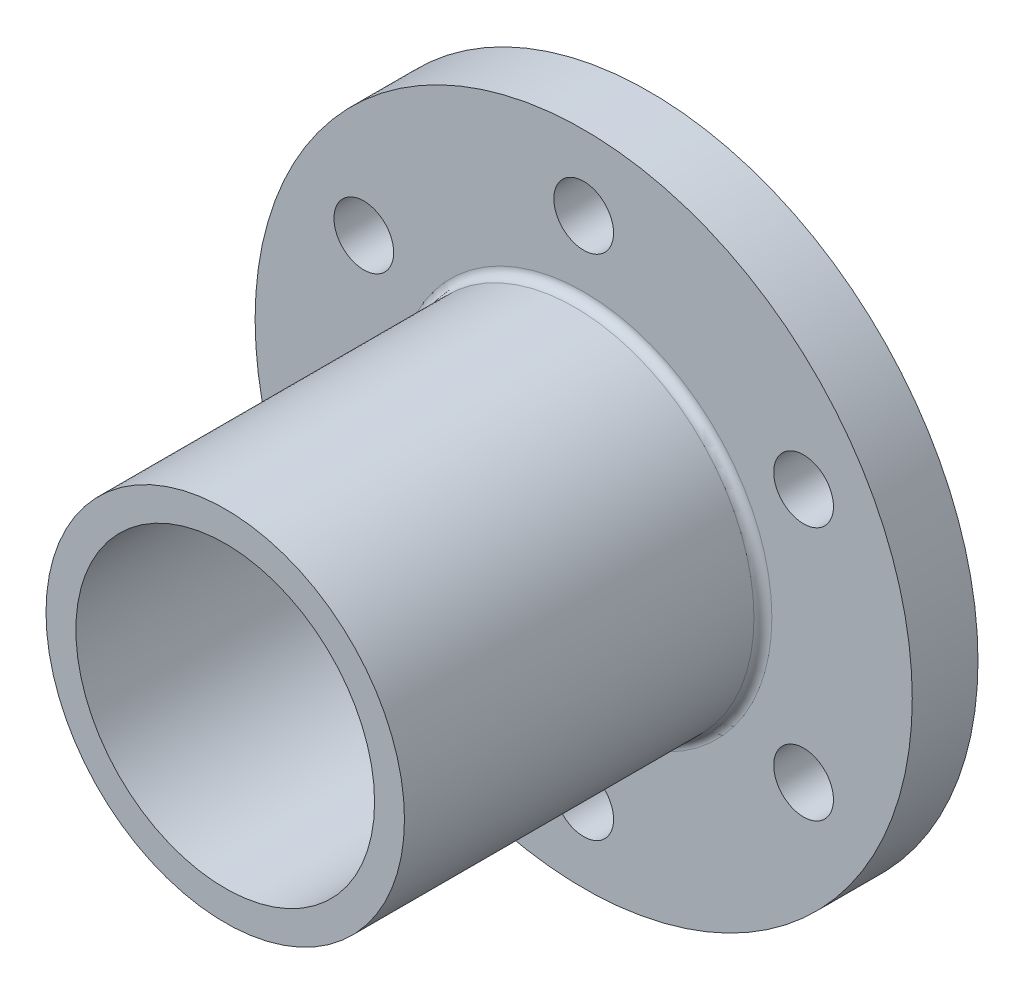
ISO-10303-21;
HEADER;
FILE_DESCRIPTION(('STEP AP214'),'2;1');
FILE_NAME('part.step','',(''),(''),'','','');
FILE_SCHEMA(('AUTOMOTIVE_DESIGN { 1 0 10303 214 1 1 1 1 }'));
ENDSEC;
DATA;
#1=APPLICATION_CONTEXT('core data for automotive mechanical design processes');
#2=APPLICATION_PROTOCOL_DEFINITION('international standard','automotive_design',2000,#1);
#3=PRODUCT_CONTEXT('',#1,'mechanical');
#4=PRODUCT('Part','Part','',(#3));
#5=PRODUCT_RELATED_PRODUCT_CATEGORY('part','',(#4));
#6=PRODUCT_DEFINITION_FORMATION('','',#4);
#7=PRODUCT_DEFINITION_CONTEXT('part definition',#1,'design');
#8=PRODUCT_DEFINITION('design','',#6,#7);
#9=PRODUCT_DEFINITION_SHAPE('','',#8);
#10=(LENGTH_UNIT() NAMED_UNIT(*) SI_UNIT(.MILLI.,.METRE.));
#11=(NAMED_UNIT(*) PLANE_ANGLE_UNIT() SI_UNIT($,.RADIAN.));
#12=(NAMED_UNIT(*) SI_UNIT($,.STERADIAN.) SOLID_ANGLE_UNIT());
#13=UNCERTAINTY_MEASURE_WITH_UNIT(LENGTH_MEASURE(1.E-05),#10,'distance_accuracy_value','');
#14=(GEOMETRIC_REPRESENTATION_CONTEXT(3) GLOBAL_UNCERTAINTY_ASSIGNED_CONTEXT((#13)) GLOBAL_UNIT_ASSIGNED_CONTEXT((#10,
#11,#12)) REPRESENTATION_CONTEXT('',''));
#15=CARTESIAN_POINT('',(0.,0.,0.));
#16=DIRECTION('',(0.,0.,1.));
#17=DIRECTION('',(1.,0.,0.));
#18=AXIS2_PLACEMENT_3D('',#15,#16,#17);
#19=CARTESIAN_POINT('',(0.,0.,22.));
#20=DIRECTION('',(0.,0.,1.));
#21=DIRECTION('',(1.,0.,0.));
#22=AXIS2_PLACEMENT_3D('',#19,#20,#21);
#23=PLANE('',#22);
#24=CARTESIAN_POINT('',(0.,0.,22.));
#25=DIRECTION('',(0.,0.,1.));
#26=DIRECTION('',(1.,0.,0.));
#27=AXIS2_PLACEMENT_3D('',#24,#25,#26);
#28=CIRCLE('',#27,63.);
#29=CARTESIAN_POINT('',(63.,0.,22.));
#30=VERTEX_POINT('',#29);
#31=EDGE_CURVE('E10',#30,#30,#28,.F.);
#32=ORIENTED_EDGE('',*,*,#31,.T.);
#33=EDGE_LOOP('',(#32));
#34=FACE_BOUND('',#33,.T.);
#35=CARTESIAN_POINT('',(-73.6121593216749,42.4999999999958,22.));
#36=DIRECTION('',(0.,0.,1.));
#37=DIRECTION('',(1.,0.,0.));
#38=AXIS2_PLACEMENT_3D('',#35,#36,#37);
#39=CIRCLE('',#38,10.0000000000045);
#40=CARTESIAN_POINT('',(-63.6121593216704,42.4999999999958,22.));
#41=VERTEX_POINT('',#40);
#42=EDGE_CURVE('E91',#41,#41,#39,.T.);
#43=ORIENTED_EDGE('',*,*,#42,.F.);
#44=EDGE_LOOP('',(#43));
#45=FACE_BOUND('',#44,.T.);
#46=CARTESIAN_POINT('',(-73.61215932167,-42.5000000000042,22.));
#47=DIRECTION('',(0.,0.,1.));
#48=DIRECTION('',(1.,0.,0.));
#49=AXIS2_PLACEMENT_3D('',#46,#47,#48);
#50=CIRCLE('',#49,10.0000000000089);
#51=CARTESIAN_POINT('',(-63.6121593216611,-42.5000000000042,22.));
#52=VERTEX_POINT('',#51);
#53=EDGE_CURVE('E85',#52,#52,#50,.T.);
#54=ORIENTED_EDGE('',*,*,#53,.F.);
#55=EDGE_LOOP('',(#54));
#56=FACE_BOUND('',#55,.T.);
#57=CARTESIAN_POINT('',(9.64256221075186E-12,-85.,22.));
#58=DIRECTION('',(0.,0.,1.));
#59=DIRECTION('',(1.,0.,0.));
#60=AXIS2_PLACEMENT_3D('',#57,#58,#59);
#61=CIRCLE('',#60,10.0000000000098);
#62=CARTESIAN_POINT('',(10.0000000000194,-85.,22.));
#63=VERTEX_POINT('',#62);
#64=EDGE_CURVE('E79',#63,#63,#61,.T.);
#65=ORIENTED_EDGE('',*,*,#64,.F.);
#66=EDGE_LOOP('',(#65));
#67=FACE_BOUND('',#66,.T.);
#68=CARTESIAN_POINT('',(73.6121593216845,-42.4999999999958,22.));
#69=DIRECTION('',(0.,0.,1.));
#70=DIRECTION('',(1.,0.,0.));
#71=AXIS2_PLACEMENT_3D('',#68,#69,#70);
#72=CIRCLE('',#71,10.0000000000061);
#73=CARTESIAN_POINT('',(83.6121593216906,-42.4999999999958,22.));
#74=VERTEX_POINT('',#73);
#75=EDGE_CURVE('E73',#74,#74,#72,.T.);
#76=ORIENTED_EDGE('',*,*,#75,.F.);
#77=EDGE_LOOP('',(#76));
#78=FACE_BOUND('',#77,.T.);
#79=CARTESIAN_POINT('',(73.6121593216797,42.5000000000042,22.));
#80=DIRECTION('',(0.,0.,1.));
#81=DIRECTION('',(1.,0.,0.));
#82=AXIS2_PLACEMENT_3D('',#79,#80,#81);
#83=CIRCLE('',#82,10.0000000000013);
#84=CARTESIAN_POINT('',(83.612159321681,42.5000000000042,22.));
#85=VERTEX_POINT('',#84);
#86=EDGE_CURVE('E67',#85,#85,#83,.T.);
#87=ORIENTED_EDGE('',*,*,#86,.F.);
#88=EDGE_LOOP('',(#87));
#89=FACE_BOUND('',#88,.T.);
#90=CARTESIAN_POINT('',(0.,85.,22.));
#91=DIRECTION('',(0.,0.,1.));
#92=DIRECTION('',(1.,0.,0.));
#93=AXIS2_PLACEMENT_3D('',#90,#91,#92);
#94=CIRCLE('',#93,10.);
#95=CARTESIAN_POINT('',(10.,85.,22.));
#96=VERTEX_POINT('',#95);
#97=EDGE_CURVE('E61',#96,#96,#94,.T.);
#98=ORIENTED_EDGE('',*,*,#97,.F.);
#99=EDGE_LOOP('',(#98));
#100=FACE_BOUND('',#99,.T.);
#101=CARTESIAN_POINT('',(0.,0.,22.));
#102=DIRECTION('',(0.,0.,1.));
#103=DIRECTION('',(1.,0.,0.));
#104=AXIS2_PLACEMENT_3D('',#101,#102,#103);
#105=CIRCLE('',#104,110.);
#106=CARTESIAN_POINT('',(110.,0.,22.));
#107=VERTEX_POINT('',#106);
#108=EDGE_CURVE('E42',#107,#107,#105,.T.);
#109=ORIENTED_EDGE('',*,*,#108,.T.);
#110=EDGE_LOOP('',(#109));
#111=FACE_BOUND('',#110,.T.);
#112=ADVANCED_FACE('F31',(#34,#45,#56,#67,#78,#89,#100,#111),#23,.T.);
#113=CARTESIAN_POINT('',(0.,0.,22.));
#114=DIRECTION('',(0.,0.,-1.));
#115=DIRECTION('',(-1.,0.,0.));
#116=AXIS2_PLACEMENT_3D('',#113,#114,#115);
#117=CYLINDRICAL_SURFACE('',#116,110.);
#118=ORIENTED_EDGE('',*,*,#108,.F.);
#119=EDGE_LOOP('',(#118));
#120=FACE_BOUND('',#119,.T.);
#121=CARTESIAN_POINT('',(0.,0.,0.));
#122=DIRECTION('',(0.,0.,1.));
#123=DIRECTION('',(1.,0.,0.));
#124=AXIS2_PLACEMENT_3D('',#121,#122,#123);
#125=CIRCLE('',#124,110.);
#126=CARTESIAN_POINT('',(110.,0.,0.));
#127=VERTEX_POINT('',#126);
#128=EDGE_CURVE('E46',#127,#127,#125,.T.);
#129=ORIENTED_EDGE('',*,*,#128,.T.);
#130=EDGE_LOOP('',(#129));
#131=FACE_BOUND('',#130,.T.);
#132=ADVANCED_FACE('F109',(#120,#131),#117,.T.);
#133=CARTESIAN_POINT('',(0.,0.,0.));
#134=DIRECTION('',(0.,0.,1.));
#135=DIRECTION('',(1.,0.,0.));
#136=AXIS2_PLACEMENT_3D('',#133,#134,#135);
#137=PLANE('',#136);
#138=CARTESIAN_POINT('',(-73.6121593216749,42.4999999999958,0.));
#139=DIRECTION('',(0.,0.,1.));
#140=DIRECTION('',(1.,0.,0.));
#141=AXIS2_PLACEMENT_3D('',#138,#139,#140);
#142=CIRCLE('',#141,10.0000000000045);
#143=CARTESIAN_POINT('',(-63.6121593216704,42.4999999999958,0.));
#144=VERTEX_POINT('',#143);
#145=EDGE_CURVE('E88',#144,#144,#142,.T.);
#146=ORIENTED_EDGE('',*,*,#145,.T.);
#147=EDGE_LOOP('',(#146));
#148=FACE_BOUND('',#147,.T.);
#149=CARTESIAN_POINT('',(-73.61215932167,-42.5000000000042,0.));
#150=DIRECTION('',(0.,0.,1.));
#151=DIRECTION('',(1.,0.,0.));
#152=AXIS2_PLACEMENT_3D('',#149,#150,#151);
#153=CIRCLE('',#152,10.0000000000089);
#154=CARTESIAN_POINT('',(-63.6121593216611,-42.5000000000042,0.));
#155=VERTEX_POINT('',#154);
#156=EDGE_CURVE('E82',#155,#155,#153,.T.);
#157=ORIENTED_EDGE('',*,*,#156,.T.);
#158=EDGE_LOOP('',(#157));
#159=FACE_BOUND('',#158,.T.);
#160=CARTESIAN_POINT('',(9.64256221075186E-12,-85.,0.));
#161=DIRECTION('',(0.,0.,1.));
#162=DIRECTION('',(1.,0.,0.));
#163=AXIS2_PLACEMENT_3D('',#160,#161,#162);
#164=CIRCLE('',#163,10.0000000000098);
#165=CARTESIAN_POINT('',(10.0000000000194,-85.,0.));
#166=VERTEX_POINT('',#165);
#167=EDGE_CURVE('E76',#166,#166,#164,.T.);
#168=ORIENTED_EDGE('',*,*,#167,.T.);
#169=EDGE_LOOP('',(#168));
#170=FACE_BOUND('',#169,.T.);
#171=CARTESIAN_POINT('',(73.6121593216845,-42.4999999999958,0.));
#172=DIRECTION('',(0.,0.,1.));
#173=DIRECTION('',(1.,0.,0.));
#174=AXIS2_PLACEMENT_3D('',#171,#172,#173);
#175=CIRCLE('',#174,10.0000000000061);
#176=CARTESIAN_POINT('',(83.6121593216906,-42.4999999999958,0.));
#177=VERTEX_POINT('',#176);
#178=EDGE_CURVE('E70',#177,#177,#175,.T.);
#179=ORIENTED_EDGE('',*,*,#178,.T.);
#180=EDGE_LOOP('',(#179));
#181=FACE_BOUND('',#180,.T.);
#182=CARTESIAN_POINT('',(73.6121593216797,42.5000000000042,0.));
#183=DIRECTION('',(0.,0.,1.));
#184=DIRECTION('',(1.,0.,0.));
#185=AXIS2_PLACEMENT_3D('',#182,#183,#184);
#186=CIRCLE('',#185,10.0000000000013);
#187=CARTESIAN_POINT('',(83.612159321681,42.5000000000042,0.));
#188=VERTEX_POINT('',#187);
#189=EDGE_CURVE('E64',#188,#188,#186,.T.);
#190=ORIENTED_EDGE('',*,*,#189,.T.);
#191=EDGE_LOOP('',(#190));
#192=FACE_BOUND('',#191,.T.);
#193=CARTESIAN_POINT('',(0.,85.,0.));
#194=DIRECTION('',(0.,0.,1.));
#195=DIRECTION('',(1.,0.,0.));
#196=AXIS2_PLACEMENT_3D('',#193,#194,#195);
#197=CIRCLE('',#196,10.);
#198=CARTESIAN_POINT('',(10.,85.,0.));
#199=VERTEX_POINT('',#198);
#200=EDGE_CURVE('E58',#199,#199,#197,.T.);
#201=ORIENTED_EDGE('',*,*,#200,.T.);
#202=EDGE_LOOP('',(#201));
#203=FACE_BOUND('',#202,.T.);
#204=CARTESIAN_POINT('',(0.,0.,0.));
#205=DIRECTION('',(0.,0.,1.));
#206=DIRECTION('',(1.,0.,0.));
#207=AXIS2_PLACEMENT_3D('',#204,#205,#206);
#208=CIRCLE('',#207,50.);
#209=CARTESIAN_POINT('',(50.,0.,0.));
#210=VERTEX_POINT('',#209);
#211=EDGE_CURVE('E54',#210,#210,#208,.T.);
#212=ORIENTED_EDGE('',*,*,#211,.T.);
#213=EDGE_LOOP('',(#212));
#214=FACE_BOUND('',#213,.T.);
#215=ORIENTED_EDGE('',*,*,#128,.F.);
#216=EDGE_LOOP('',(#215));
#217=FACE_BOUND('',#216,.T.);
#218=ADVANCED_FACE('F97',(#148,#159,#170,#181,#192,#203,#214,#217),#137,.F.);
#219=CARTESIAN_POINT('',(0.,0.,142.));
#220=DIRECTION('',(0.,0.,-1.));
#221=DIRECTION('',(-1.,0.,0.));
#222=AXIS2_PLACEMENT_3D('',#219,#220,#221);
#223=CYLINDRICAL_SURFACE('',#222,60.);
#224=CARTESIAN_POINT('',(0.,0.,25.));
#225=DIRECTION('',(0.,0.,1.));
#226=DIRECTION('',(1.,0.,0.));
#227=AXIS2_PLACEMENT_3D('',#224,#225,#226);
#228=CIRCLE('',#227,60.);
#229=CARTESIAN_POINT('',(60.,0.,25.));
#230=VERTEX_POINT('',#229);
#231=EDGE_CURVE('E38',#230,#230,#228,.T.);
#232=ORIENTED_EDGE('',*,*,#231,.T.);
#233=EDGE_LOOP('',(#232));
#234=FACE_BOUND('',#233,.T.);
#235=CARTESIAN_POINT('',(0.,0.,142.));
#236=DIRECTION('',(0.,0.,1.));
#237=DIRECTION('',(1.,0.,0.));
#238=AXIS2_PLACEMENT_3D('',#235,#236,#237);
#239=CIRCLE('',#238,60.);
#240=CARTESIAN_POINT('',(60.,0.,142.));
#241=VERTEX_POINT('',#240);
#242=EDGE_CURVE('E50',#241,#241,#239,.T.);
#243=ORIENTED_EDGE('',*,*,#242,.F.);
#244=EDGE_LOOP('',(#243));
#245=FACE_BOUND('',#244,.T.);
#246=ADVANCED_FACE('F128',(#234,#245),#223,.T.);
#247=CARTESIAN_POINT('',(0.,0.,142.));
#248=DIRECTION('',(0.,0.,1.));
#249=DIRECTION('',(1.,0.,0.));
#250=AXIS2_PLACEMENT_3D('',#247,#248,#249);
#251=PLANE('',#250);
#252=CARTESIAN_POINT('',(0.,0.,142.));
#253=DIRECTION('',(0.,0.,1.));
#254=DIRECTION('',(1.,0.,0.));
#255=AXIS2_PLACEMENT_3D('',#252,#253,#254);
#256=CIRCLE('',#255,50.);
#257=CARTESIAN_POINT('',(50.,0.,142.));
#258=VERTEX_POINT('',#257);
#259=EDGE_CURVE('E55',#258,#258,#256,.T.);
#260=ORIENTED_EDGE('',*,*,#259,.F.);
#261=EDGE_LOOP('',(#260));
#262=FACE_BOUND('',#261,.T.);
#263=ORIENTED_EDGE('',*,*,#242,.T.);
#264=EDGE_LOOP('',(#263));
#265=FACE_BOUND('',#264,.T.);
#266=ADVANCED_FACE('F133',(#262,#265),#251,.T.);
#267=CARTESIAN_POINT('',(0.,0.,0.));
#268=DIRECTION('',(0.,0.,1.));
#269=DIRECTION('',(1.,0.,0.));
#270=AXIS2_PLACEMENT_3D('',#267,#268,#269);
#271=CYLINDRICAL_SURFACE('',#270,50.);
#272=ORIENTED_EDGE('',*,*,#211,.F.);
#273=EDGE_LOOP('',(#272));
#274=FACE_BOUND('',#273,.T.);
#275=ORIENTED_EDGE('',*,*,#259,.T.);
#276=EDGE_LOOP('',(#275));
#277=FACE_BOUND('',#276,.T.);
#278=ADVANCED_FACE('F138',(#274,#277),#271,.F.);
#279=CARTESIAN_POINT('',(0.,85.,0.));
#280=DIRECTION('',(0.,0.,1.));
#281=DIRECTION('',(1.,0.,0.));
#282=AXIS2_PLACEMENT_3D('',#279,#280,#281);
#283=CYLINDRICAL_SURFACE('',#282,10.);
#284=ORIENTED_EDGE('',*,*,#200,.F.);
#285=EDGE_LOOP('',(#284));
#286=FACE_BOUND('',#285,.T.);
#287=ORIENTED_EDGE('',*,*,#97,.T.);
#288=EDGE_LOOP('',(#287));
#289=FACE_BOUND('',#288,.T.);
#290=ADVANCED_FACE('F142',(#286,#289),#283,.F.);
#291=CARTESIAN_POINT('',(73.6121593216797,42.5000000000042,0.));
#292=DIRECTION('',(0.,0.,1.));
#293=DIRECTION('',(1.,0.,0.));
#294=AXIS2_PLACEMENT_3D('',#291,#292,#293);
#295=CYLINDRICAL_SURFACE('',#294,10.0000000000013);
#296=ORIENTED_EDGE('',*,*,#189,.F.);
#297=EDGE_LOOP('',(#296));
#298=FACE_BOUND('',#297,.T.);
#299=ORIENTED_EDGE('',*,*,#86,.T.);
#300=EDGE_LOOP('',(#299));
#301=FACE_BOUND('',#300,.T.);
#302=ADVANCED_FACE('F146',(#298,#301),#295,.F.);
#303=CARTESIAN_POINT('',(73.6121593216845,-42.4999999999958,0.));
#304=DIRECTION('',(0.,0.,1.));
#305=DIRECTION('',(1.,0.,0.));
#306=AXIS2_PLACEMENT_3D('',#303,#304,#305);
#307=CYLINDRICAL_SURFACE('',#306,10.0000000000061);
#308=ORIENTED_EDGE('',*,*,#178,.F.);
#309=EDGE_LOOP('',(#308));
#310=FACE_BOUND('',#309,.T.);
#311=ORIENTED_EDGE('',*,*,#75,.T.);
#312=EDGE_LOOP('',(#311));
#313=FACE_BOUND('',#312,.T.);
#314=ADVANCED_FACE('F150',(#310,#313),#307,.F.);
#315=CARTESIAN_POINT('',(9.64256221075186E-12,-85.,0.));
#316=DIRECTION('',(0.,0.,1.));
#317=DIRECTION('',(1.,0.,0.));
#318=AXIS2_PLACEMENT_3D('',#315,#316,#317);
#319=CYLINDRICAL_SURFACE('',#318,10.0000000000098);
#320=ORIENTED_EDGE('',*,*,#167,.F.);
#321=EDGE_LOOP('',(#320));
#322=FACE_BOUND('',#321,.T.);
#323=ORIENTED_EDGE('',*,*,#64,.T.);
#324=EDGE_LOOP('',(#323));
#325=FACE_BOUND('',#324,.T.);
#326=ADVANCED_FACE('F154',(#322,#325),#319,.F.);
#327=CARTESIAN_POINT('',(-73.61215932167,-42.5000000000042,0.));
#328=DIRECTION('',(0.,0.,1.));
#329=DIRECTION('',(1.,0.,0.));
#330=AXIS2_PLACEMENT_3D('',#327,#328,#329);
#331=CYLINDRICAL_SURFACE('',#330,10.0000000000089);
#332=ORIENTED_EDGE('',*,*,#156,.F.);
#333=EDGE_LOOP('',(#332));
#334=FACE_BOUND('',#333,.T.);
#335=ORIENTED_EDGE('',*,*,#53,.T.);
#336=EDGE_LOOP('',(#335));
#337=FACE_BOUND('',#336,.T.);
#338=ADVANCED_FACE('F103',(#334,#337),#331,.F.);
#339=CARTESIAN_POINT('',(-73.6121593216749,42.4999999999958,0.));
#340=DIRECTION('',(0.,0.,1.));
#341=DIRECTION('',(1.,0.,0.));
#342=AXIS2_PLACEMENT_3D('',#339,#340,#341);
#343=CYLINDRICAL_SURFACE('',#342,10.0000000000045);
#344=ORIENTED_EDGE('',*,*,#145,.F.);
#345=EDGE_LOOP('',(#344));
#346=FACE_BOUND('',#345,.T.);
#347=ORIENTED_EDGE('',*,*,#42,.T.);
#348=EDGE_LOOP('',(#347));
#349=FACE_BOUND('',#348,.T.);
#350=ADVANCED_FACE('F100',(#346,#349),#343,.F.);
#351=CARTESIAN_POINT('',(0.,0.,25.));
#352=DIRECTION('',(0.,0.,1.));
#353=DIRECTION('',(1.,0.,0.));
#354=AXIS2_PLACEMENT_3D('',#351,#352,#353);
#355=TOROIDAL_SURFACE('',#354,63.,3.);
#356=ORIENTED_EDGE('',*,*,#31,.F.);
#357=EDGE_LOOP('',(#356));
#358=FACE_BOUND('',#357,.T.);
#359=ORIENTED_EDGE('',*,*,#231,.F.);
#360=EDGE_LOOP('',(#359));
#361=FACE_BOUND('',#360,.T.);
#362=ADVANCED_FACE('F33',(#358,#361),#355,.F.);
#363=CLOSED_SHELL('',(#112,#132,#218,#246,#266,#278,#290,#302,#314,#326,#338,#350,#362));
#364=MANIFOLD_SOLID_BREP('B2',#363);
#365=ADVANCED_BREP_SHAPE_REPRESENTATION('',(#18,#364),#14);
#366=SHAPE_DEFINITION_REPRESENTATION(#9,#365);
ENDSEC;
END-ISO-10303-21;
